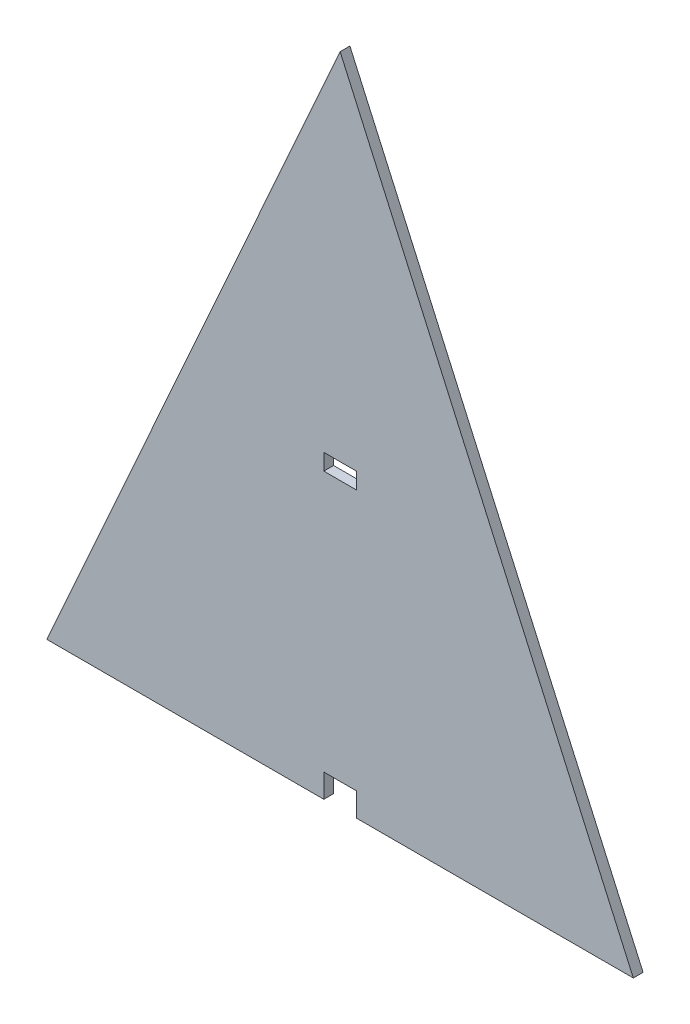
ISO-10303-21;
HEADER;
FILE_DESCRIPTION(('STEP AP214'),'2;1');
FILE_NAME('part.step','',(''),(''),'','','');
FILE_SCHEMA(('AUTOMOTIVE_DESIGN { 1 0 10303 214 1 1 1 1 }'));
ENDSEC;
DATA;
#1=APPLICATION_CONTEXT('core data for automotive mechanical design processes');
#2=APPLICATION_PROTOCOL_DEFINITION('international standard','automotive_design',2000,#1);
#3=PRODUCT_CONTEXT('',#1,'mechanical');
#4=PRODUCT('Part','Part','',(#3));
#5=PRODUCT_RELATED_PRODUCT_CATEGORY('part','',(#4));
#6=PRODUCT_DEFINITION_FORMATION('','',#4);
#7=PRODUCT_DEFINITION_CONTEXT('part definition',#1,'design');
#8=PRODUCT_DEFINITION('design','',#6,#7);
#9=PRODUCT_DEFINITION_SHAPE('','',#8);
#10=(LENGTH_UNIT() NAMED_UNIT(*) SI_UNIT(.MILLI.,.METRE.));
#11=(NAMED_UNIT(*) PLANE_ANGLE_UNIT() SI_UNIT($,.RADIAN.));
#12=(NAMED_UNIT(*) SI_UNIT($,.STERADIAN.) SOLID_ANGLE_UNIT());
#13=UNCERTAINTY_MEASURE_WITH_UNIT(LENGTH_MEASURE(1.E-05),#10,'distance_accuracy_value','');
#14=(GEOMETRIC_REPRESENTATION_CONTEXT(3) GLOBAL_UNCERTAINTY_ASSIGNED_CONTEXT((#13)) GLOBAL_UNIT_ASSIGNED_CONTEXT((#10,
#11,#12)) REPRESENTATION_CONTEXT('',''));
#15=CARTESIAN_POINT('',(0.,0.,0.));
#16=DIRECTION('',(0.,0.,1.));
#17=DIRECTION('',(1.,0.,0.));
#18=AXIS2_PLACEMENT_3D('',#15,#16,#17);
#19=CARTESIAN_POINT('',(0.,7.26000000000002,3.));
#20=DIRECTION('',(0.,1.,0.));
#21=DIRECTION('',(0.,0.,1.));
#22=AXIS2_PLACEMENT_3D('',#19,#20,#21);
#23=PLANE('',#22);
#24=DIRECTION('',(1.,0.,0.));
#25=VECTOR('',#24,1.);
#26=CARTESIAN_POINT('',(0.,7.26000000000002,0.));
#27=LINE('',#26,#25);
#28=CARTESIAN_POINT('',(85.,7.26000000000002,0.));
#29=VERTEX_POINT('',#28);
#30=CARTESIAN_POINT('',(94.9999999999997,7.26000000000002,0.));
#31=VERTEX_POINT('',#30);
#32=EDGE_CURVE('E218',#29,#31,#27,.T.);
#33=ORIENTED_EDGE('',*,*,#32,.T.);
#34=DIRECTION('',(0.,0.,-1.));
#35=VECTOR('',#34,1.);
#36=CARTESIAN_POINT('',(94.9999999999997,7.26000000000002,3.));
#37=LINE('',#36,#35);
#38=CARTESIAN_POINT('',(94.9999999999997,7.26000000000002,3.));
#39=VERTEX_POINT('',#38);
#40=EDGE_CURVE('E11',#39,#31,#37,.T.);
#41=ORIENTED_EDGE('',*,*,#40,.F.);
#42=DIRECTION('',(1.,0.,0.));
#43=VECTOR('',#42,1.);
#44=CARTESIAN_POINT('',(0.,7.26000000000002,3.));
#45=LINE('',#44,#43);
#46=CARTESIAN_POINT('',(85.,7.26000000000002,3.));
#47=VERTEX_POINT('',#46);
#48=EDGE_CURVE('E161',#47,#39,#45,.T.);
#49=ORIENTED_EDGE('',*,*,#48,.F.);
#50=DIRECTION('',(0.,0.,-1.));
#51=VECTOR('',#50,1.);
#52=CARTESIAN_POINT('',(85.,7.26000000000002,3.));
#53=LINE('',#52,#51);
#54=EDGE_CURVE('E56',#47,#29,#53,.T.);
#55=ORIENTED_EDGE('',*,*,#54,.T.);
#56=EDGE_LOOP('',(#33,#41,#49,#55));
#57=FACE_BOUND('',#56,.T.);
#58=ADVANCED_FACE('F37',(#57),#23,.F.);
#59=CARTESIAN_POINT('',(94.9999999999997,0.,3.));
#60=DIRECTION('',(1.,0.,0.));
#61=DIRECTION('',(0.,0.,-1.));
#62=AXIS2_PLACEMENT_3D('',#59,#60,#61);
#63=PLANE('',#62);
#64=DIRECTION('',(0.,-1.,0.));
#65=VECTOR('',#64,1.);
#66=CARTESIAN_POINT('',(94.9999999999997,0.,0.));
#67=LINE('',#66,#65);
#68=CARTESIAN_POINT('',(94.9999999999997,0.,0.));
#69=VERTEX_POINT('',#68);
#70=EDGE_CURVE('E220',#31,#69,#67,.T.);
#71=ORIENTED_EDGE('',*,*,#70,.T.);
#72=DIRECTION('',(0.,0.,-1.));
#73=VECTOR('',#72,1.);
#74=CARTESIAN_POINT('',(94.9999999999997,0.,3.));
#75=LINE('',#74,#73);
#76=CARTESIAN_POINT('',(94.9999999999997,0.,3.));
#77=VERTEX_POINT('',#76);
#78=EDGE_CURVE('E47',#77,#69,#75,.T.);
#79=ORIENTED_EDGE('',*,*,#78,.F.);
#80=DIRECTION('',(0.,-1.,0.));
#81=VECTOR('',#80,1.);
#82=CARTESIAN_POINT('',(94.9999999999997,0.,3.));
#83=LINE('',#82,#81);
#84=EDGE_CURVE('E158',#39,#77,#83,.T.);
#85=ORIENTED_EDGE('',*,*,#84,.F.);
#86=ORIENTED_EDGE('',*,*,#40,.T.);
#87=EDGE_LOOP('',(#71,#79,#85,#86));
#88=FACE_BOUND('',#87,.T.);
#89=ADVANCED_FACE('F236',(#88),#63,.F.);
#90=CARTESIAN_POINT('',(0.,0.,3.));
#91=DIRECTION('',(0.,1.,0.));
#92=DIRECTION('',(0.,0.,1.));
#93=AXIS2_PLACEMENT_3D('',#90,#91,#92);
#94=PLANE('',#93);
#95=DIRECTION('',(1.,0.,0.));
#96=VECTOR('',#95,1.);
#97=CARTESIAN_POINT('',(0.,0.,0.));
#98=LINE('',#97,#96);
#99=CARTESIAN_POINT('',(180.,0.,0.));
#100=VERTEX_POINT('',#99);
#101=EDGE_CURVE('E179',#69,#100,#98,.T.);
#102=ORIENTED_EDGE('',*,*,#101,.T.);
#103=DIRECTION('',(0.,0.,-1.));
#104=VECTOR('',#103,1.);
#105=CARTESIAN_POINT('',(180.,0.,3.));
#106=LINE('',#105,#104);
#107=CARTESIAN_POINT('',(180.,0.,3.));
#108=VERTEX_POINT('',#107);
#109=EDGE_CURVE('E186',#108,#100,#106,.T.);
#110=ORIENTED_EDGE('',*,*,#109,.F.);
#111=DIRECTION('',(1.,0.,0.));
#112=VECTOR('',#111,1.);
#113=CARTESIAN_POINT('',(0.,0.,3.));
#114=LINE('',#113,#112);
#115=EDGE_CURVE('E153',#77,#108,#114,.T.);
#116=ORIENTED_EDGE('',*,*,#115,.F.);
#117=ORIENTED_EDGE('',*,*,#78,.T.);
#118=EDGE_LOOP('',(#102,#110,#116,#117));
#119=FACE_BOUND('',#118,.T.);
#120=ADVANCED_FACE('F241',(#119),#94,.F.);
#121=CARTESIAN_POINT('',(150.000964475165,67.081176659701,3.));
#122=DIRECTION('',(-0.912873863975025,-0.408241727988831,0.));
#123=DIRECTION('',(0.408241727988831,-0.912873863975025,0.));
#124=AXIS2_PLACEMENT_3D('',#121,#122,#123);
#125=PLANE('',#124);
#126=DIRECTION('',(-0.408241727988831,0.912873863975025,0.));
#127=VECTOR('',#126,1.);
#128=CARTESIAN_POINT('',(150.000964475165,67.081176659701,0.));
#129=LINE('',#128,#127);
#130=CARTESIAN_POINT('',(90.,201.25,0.));
#131=VERTEX_POINT('',#130);
#132=EDGE_CURVE('E221',#100,#131,#129,.T.);
#133=ORIENTED_EDGE('',*,*,#132,.T.);
#134=DIRECTION('',(0.,0.,-1.));
#135=VECTOR('',#134,1.);
#136=CARTESIAN_POINT('',(90.,201.25,3.));
#137=LINE('',#136,#135);
#138=CARTESIAN_POINT('',(90.,201.25,3.));
#139=VERTEX_POINT('',#138);
#140=EDGE_CURVE('E148',#139,#131,#137,.T.);
#141=ORIENTED_EDGE('',*,*,#140,.F.);
#142=DIRECTION('',(-0.408241727988831,0.912873863975025,0.));
#143=VECTOR('',#142,1.);
#144=CARTESIAN_POINT('',(150.000964475165,67.081176659701,3.));
#145=LINE('',#144,#143);
#146=EDGE_CURVE('E136',#108,#139,#145,.T.);
#147=ORIENTED_EDGE('',*,*,#146,.F.);
#148=ORIENTED_EDGE('',*,*,#109,.T.);
#149=EDGE_LOOP('',(#133,#141,#147,#148));
#150=FACE_BOUND('',#149,.T.);
#151=ADVANCED_FACE('F224',(#150),#125,.F.);
#152=CARTESIAN_POINT('',(0.,0.,3.));
#153=DIRECTION('',(0.912873863975025,-0.408241727988831,0.));
#154=DIRECTION('',(0.408241727988831,0.912873863975025,0.));
#155=AXIS2_PLACEMENT_3D('',#152,#153,#154);
#156=PLANE('',#155);
#157=DIRECTION('',(-0.408241727988831,-0.912873863975025,0.));
#158=VECTOR('',#157,1.);
#159=CARTESIAN_POINT('',(0.,0.,0.));
#160=LINE('',#159,#158);
#161=CARTESIAN_POINT('',(0.,0.,0.));
#162=VERTEX_POINT('',#161);
#163=EDGE_CURVE('E145',#131,#162,#160,.T.);
#164=ORIENTED_EDGE('',*,*,#163,.T.);
#165=DIRECTION('',(0.,0.,-1.));
#166=VECTOR('',#165,1.);
#167=CARTESIAN_POINT('',(0.,0.,3.));
#168=LINE('',#167,#166);
#169=CARTESIAN_POINT('',(0.,0.,3.));
#170=VERTEX_POINT('',#169);
#171=EDGE_CURVE('E142',#170,#162,#168,.T.);
#172=ORIENTED_EDGE('',*,*,#171,.F.);
#173=DIRECTION('',(-0.408241727988831,-0.912873863975025,0.));
#174=VECTOR('',#173,1.);
#175=CARTESIAN_POINT('',(0.,0.,3.));
#176=LINE('',#175,#174);
#177=EDGE_CURVE('E128',#139,#170,#176,.T.);
#178=ORIENTED_EDGE('',*,*,#177,.F.);
#179=ORIENTED_EDGE('',*,*,#140,.T.);
#180=EDGE_LOOP('',(#164,#172,#178,#179));
#181=FACE_BOUND('',#180,.T.);
#182=ADVANCED_FACE('F143',(#181),#156,.F.);
#183=CARTESIAN_POINT('',(85.,0.,0.));
#184=VERTEX_POINT('',#183);
#185=EDGE_CURVE('E175',#162,#184,#98,.T.);
#186=ORIENTED_EDGE('',*,*,#185,.T.);
#187=DIRECTION('',(0.,0.,-1.));
#188=VECTOR('',#187,1.);
#189=CARTESIAN_POINT('',(85.,0.,3.));
#190=LINE('',#189,#188);
#191=CARTESIAN_POINT('',(85.,0.,3.));
#192=VERTEX_POINT('',#191);
#193=EDGE_CURVE('E92',#192,#184,#190,.T.);
#194=ORIENTED_EDGE('',*,*,#193,.F.);
#195=EDGE_CURVE('E134',#170,#192,#114,.T.);
#196=ORIENTED_EDGE('',*,*,#195,.F.);
#197=ORIENTED_EDGE('',*,*,#171,.T.);
#198=EDGE_LOOP('',(#186,#194,#196,#197));
#199=FACE_BOUND('',#198,.T.);
#200=ADVANCED_FACE('F150',(#199),#94,.F.);
#201=CARTESIAN_POINT('',(85.,0.,3.));
#202=DIRECTION('',(1.,0.,0.));
#203=DIRECTION('',(0.,0.,-1.));
#204=AXIS2_PLACEMENT_3D('',#201,#202,#203);
#205=PLANE('',#204);
#206=DIRECTION('',(0.,-1.,0.));
#207=VECTOR('',#206,1.);
#208=CARTESIAN_POINT('',(85.,0.,0.));
#209=LINE('',#208,#207);
#210=CARTESIAN_POINT('',(85.,92.2374444444444,0.));
#211=VERTEX_POINT('',#210);
#212=CARTESIAN_POINT('',(85.,87.2374444444444,0.));
#213=VERTEX_POINT('',#212);
#214=EDGE_CURVE('E205',#211,#213,#209,.T.);
#215=ORIENTED_EDGE('',*,*,#214,.F.);
#216=DIRECTION('',(0.,0.,-1.));
#217=VECTOR('',#216,1.);
#218=CARTESIAN_POINT('',(85.,92.2374444444444,3.));
#219=LINE('',#218,#217);
#220=CARTESIAN_POINT('',(85.,92.2374444444444,3.));
#221=VERTEX_POINT('',#220);
#222=EDGE_CURVE('E41',#221,#211,#219,.T.);
#223=ORIENTED_EDGE('',*,*,#222,.F.);
#224=DIRECTION('',(0.,-1.,0.));
#225=VECTOR('',#224,1.);
#226=CARTESIAN_POINT('',(85.,0.,3.));
#227=LINE('',#226,#225);
#228=CARTESIAN_POINT('',(85.,87.2374444444444,3.));
#229=VERTEX_POINT('',#228);
#230=EDGE_CURVE('E172',#221,#229,#227,.T.);
#231=ORIENTED_EDGE('',*,*,#230,.T.);
#232=DIRECTION('',(0.,0.,-1.));
#233=VECTOR('',#232,1.);
#234=CARTESIAN_POINT('',(85.,87.2374444444444,3.));
#235=LINE('',#234,#233);
#236=EDGE_CURVE('E154',#229,#213,#235,.T.);
#237=ORIENTED_EDGE('',*,*,#236,.T.);
#238=EDGE_LOOP('',(#215,#223,#231,#237));
#239=FACE_BOUND('',#238,.T.);
#240=ADVANCED_FACE('F39',(#239),#205,.T.);
#241=CARTESIAN_POINT('',(0.,92.2374444444444,3.));
#242=DIRECTION('',(0.,-1.,0.));
#243=DIRECTION('',(0.,0.,-1.));
#244=AXIS2_PLACEMENT_3D('',#241,#242,#243);
#245=PLANE('',#244);
#246=DIRECTION('',(-1.,0.,0.));
#247=VECTOR('',#246,1.);
#248=CARTESIAN_POINT('',(0.,92.2374444444444,0.));
#249=LINE('',#248,#247);
#250=CARTESIAN_POINT('',(94.9999999999997,92.2374444444444,0.));
#251=VERTEX_POINT('',#250);
#252=EDGE_CURVE('E202',#251,#211,#249,.T.);
#253=ORIENTED_EDGE('',*,*,#252,.F.);
#254=DIRECTION('',(0.,0.,-1.));
#255=VECTOR('',#254,1.);
#256=CARTESIAN_POINT('',(94.9999999999997,92.2374444444444,3.));
#257=LINE('',#256,#255);
#258=CARTESIAN_POINT('',(94.9999999999997,92.2374444444444,3.));
#259=VERTEX_POINT('',#258);
#260=EDGE_CURVE('E194',#259,#251,#257,.T.);
#261=ORIENTED_EDGE('',*,*,#260,.F.);
#262=DIRECTION('',(-1.,0.,0.));
#263=VECTOR('',#262,1.);
#264=CARTESIAN_POINT('',(0.,92.2374444444444,3.));
#265=LINE('',#264,#263);
#266=EDGE_CURVE('E169',#259,#221,#265,.T.);
#267=ORIENTED_EDGE('',*,*,#266,.T.);
#268=ORIENTED_EDGE('',*,*,#222,.T.);
#269=EDGE_LOOP('',(#253,#261,#267,#268));
#270=FACE_BOUND('',#269,.T.);
#271=ADVANCED_FACE('F200',(#270),#245,.T.);
#272=CARTESIAN_POINT('',(94.9999999999997,0.,3.));
#273=DIRECTION('',(1.,0.,0.));
#274=DIRECTION('',(0.,0.,-1.));
#275=AXIS2_PLACEMENT_3D('',#272,#273,#274);
#276=PLANE('',#275);
#277=DIRECTION('',(0.,-1.,0.));
#278=VECTOR('',#277,1.);
#279=CARTESIAN_POINT('',(94.9999999999997,0.,0.));
#280=LINE('',#279,#278);
#281=CARTESIAN_POINT('',(94.9999999999997,87.2374444444444,0.));
#282=VERTEX_POINT('',#281);
#283=EDGE_CURVE('E212',#251,#282,#280,.T.);
#284=ORIENTED_EDGE('',*,*,#283,.T.);
#285=DIRECTION('',(0.,0.,-1.));
#286=VECTOR('',#285,1.);
#287=CARTESIAN_POINT('',(94.9999999999997,87.2374444444444,3.));
#288=LINE('',#287,#286);
#289=CARTESIAN_POINT('',(94.9999999999997,87.2374444444444,3.));
#290=VERTEX_POINT('',#289);
#291=EDGE_CURVE('E192',#290,#282,#288,.T.);
#292=ORIENTED_EDGE('',*,*,#291,.F.);
#293=DIRECTION('',(0.,-1.,0.));
#294=VECTOR('',#293,1.);
#295=CARTESIAN_POINT('',(94.9999999999997,0.,3.));
#296=LINE('',#295,#294);
#297=EDGE_CURVE('E167',#259,#290,#296,.T.);
#298=ORIENTED_EDGE('',*,*,#297,.F.);
#299=ORIENTED_EDGE('',*,*,#260,.T.);
#300=EDGE_LOOP('',(#284,#292,#298,#299));
#301=FACE_BOUND('',#300,.T.);
#302=ADVANCED_FACE('F249',(#301),#276,.F.);
#303=CARTESIAN_POINT('',(1.21066274289603E-13,87.2374444444446,3.));
#304=DIRECTION('',(0.,-1.,0.));
#305=DIRECTION('',(1.,0.,0.));
#306=AXIS2_PLACEMENT_3D('',#303,#304,#305);
#307=PLANE('',#306);
#308=DIRECTION('',(-1.,0.,0.));
#309=VECTOR('',#308,1.);
#310=CARTESIAN_POINT('',(1.21066274289603E-13,87.2374444444446,0.));
#311=LINE('',#310,#309);
#312=EDGE_CURVE('E214',#282,#213,#311,.T.);
#313=ORIENTED_EDGE('',*,*,#312,.T.);
#314=ORIENTED_EDGE('',*,*,#236,.F.);
#315=DIRECTION('',(-1.,0.,0.));
#316=VECTOR('',#315,1.);
#317=CARTESIAN_POINT('',(1.21066274289603E-13,87.2374444444446,3.));
#318=LINE('',#317,#316);
#319=EDGE_CURVE('E163',#290,#229,#318,.T.);
#320=ORIENTED_EDGE('',*,*,#319,.F.);
#321=ORIENTED_EDGE('',*,*,#291,.T.);
#322=EDGE_LOOP('',(#313,#314,#320,#321));
#323=FACE_BOUND('',#322,.T.);
#324=ADVANCED_FACE('F246',(#323),#307,.F.);
#325=CARTESIAN_POINT('',(85.,0.,3.));
#326=DIRECTION('',(1.,0.,0.));
#327=DIRECTION('',(0.,0.,-1.));
#328=AXIS2_PLACEMENT_3D('',#325,#326,#327);
#329=PLANE('',#328);
#330=DIRECTION('',(0.,-1.,0.));
#331=VECTOR('',#330,1.);
#332=CARTESIAN_POINT('',(85.,0.,0.));
#333=LINE('',#332,#331);
#334=EDGE_CURVE('E173',#29,#184,#333,.T.);
#335=ORIENTED_EDGE('',*,*,#334,.F.);
#336=ORIENTED_EDGE('',*,*,#54,.F.);
#337=DIRECTION('',(0.,-1.,0.));
#338=VECTOR('',#337,1.);
#339=CARTESIAN_POINT('',(85.,0.,3.));
#340=LINE('',#339,#338);
#341=EDGE_CURVE('E151',#47,#192,#340,.T.);
#342=ORIENTED_EDGE('',*,*,#341,.T.);
#343=ORIENTED_EDGE('',*,*,#193,.T.);
#344=EDGE_LOOP('',(#335,#336,#342,#343));
#345=FACE_BOUND('',#344,.T.);
#346=ADVANCED_FACE('F231',(#345),#329,.T.);
#347=CARTESIAN_POINT('',(0.,0.,3.));
#348=DIRECTION('',(0.,0.,1.));
#349=DIRECTION('',(1.,0.,0.));
#350=AXIS2_PLACEMENT_3D('',#347,#348,#349);
#351=PLANE('',#350);
#352=ORIENTED_EDGE('',*,*,#230,.F.);
#353=ORIENTED_EDGE('',*,*,#266,.F.);
#354=ORIENTED_EDGE('',*,*,#297,.T.);
#355=ORIENTED_EDGE('',*,*,#319,.T.);
#356=EDGE_LOOP('',(#352,#353,#354,#355));
#357=FACE_BOUND('',#356,.T.);
#358=ORIENTED_EDGE('',*,*,#48,.T.);
#359=ORIENTED_EDGE('',*,*,#84,.T.);
#360=ORIENTED_EDGE('',*,*,#115,.T.);
#361=ORIENTED_EDGE('',*,*,#146,.T.);
#362=ORIENTED_EDGE('',*,*,#177,.T.);
#363=ORIENTED_EDGE('',*,*,#195,.T.);
#364=ORIENTED_EDGE('',*,*,#341,.F.);
#365=EDGE_LOOP('',(#358,#359,#360,#361,#362,#363,#364));
#366=FACE_BOUND('',#365,.T.);
#367=ADVANCED_FACE('F131',(#357,#366),#351,.T.);
#368=CARTESIAN_POINT('',(0.,0.,0.));
#369=DIRECTION('',(0.,0.,1.));
#370=DIRECTION('',(1.,0.,0.));
#371=AXIS2_PLACEMENT_3D('',#368,#369,#370);
#372=PLANE('',#371);
#373=ORIENTED_EDGE('',*,*,#214,.T.);
#374=ORIENTED_EDGE('',*,*,#312,.F.);
#375=ORIENTED_EDGE('',*,*,#283,.F.);
#376=ORIENTED_EDGE('',*,*,#252,.T.);
#377=EDGE_LOOP('',(#373,#374,#375,#376));
#378=FACE_BOUND('',#377,.T.);
#379=ORIENTED_EDGE('',*,*,#32,.F.);
#380=ORIENTED_EDGE('',*,*,#334,.T.);
#381=ORIENTED_EDGE('',*,*,#185,.F.);
#382=ORIENTED_EDGE('',*,*,#163,.F.);
#383=ORIENTED_EDGE('',*,*,#132,.F.);
#384=ORIENTED_EDGE('',*,*,#101,.F.);
#385=ORIENTED_EDGE('',*,*,#70,.F.);
#386=EDGE_LOOP('',(#379,#380,#381,#382,#383,#384,#385));
#387=FACE_BOUND('',#386,.T.);
#388=ADVANCED_FACE('F211',(#378,#387),#372,.F.);
#389=CLOSED_SHELL('',(#58,#89,#120,#151,#182,#200,#240,#271,#302,#324,#346,#367,#388));
#390=MANIFOLD_SOLID_BREP('B2',#389);
#391=ADVANCED_BREP_SHAPE_REPRESENTATION('',(#18,#390),#14);
#392=SHAPE_DEFINITION_REPRESENTATION(#9,#391);
ENDSEC;
END-ISO-10303-21;
